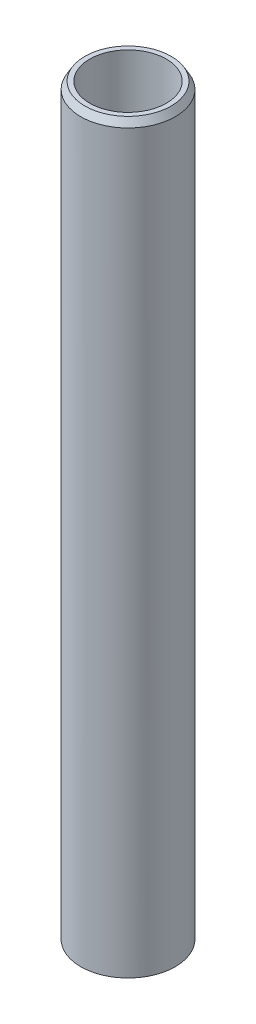
ISO-10303-21;
HEADER;
FILE_DESCRIPTION(('STEP AP214'),'2;1');
FILE_NAME('part.step','',(''),(''),'','','');
FILE_SCHEMA(('AUTOMOTIVE_DESIGN { 1 0 10303 214 1 1 1 1 }'));
ENDSEC;
DATA;
#1=APPLICATION_CONTEXT('core data for automotive mechanical design processes');
#2=APPLICATION_PROTOCOL_DEFINITION('international standard','automotive_design',2000,#1);
#3=PRODUCT_CONTEXT('',#1,'mechanical');
#4=PRODUCT('Part','Part','',(#3));
#5=PRODUCT_RELATED_PRODUCT_CATEGORY('part','',(#4));
#6=PRODUCT_DEFINITION_FORMATION('','',#4);
#7=PRODUCT_DEFINITION_CONTEXT('part definition',#1,'design');
#8=PRODUCT_DEFINITION('design','',#6,#7);
#9=PRODUCT_DEFINITION_SHAPE('','',#8);
#10=(LENGTH_UNIT() NAMED_UNIT(*) SI_UNIT(.MILLI.,.METRE.));
#11=(NAMED_UNIT(*) PLANE_ANGLE_UNIT() SI_UNIT($,.RADIAN.));
#12=(NAMED_UNIT(*) SI_UNIT($,.STERADIAN.) SOLID_ANGLE_UNIT());
#13=UNCERTAINTY_MEASURE_WITH_UNIT(LENGTH_MEASURE(1.E-05),#10,'distance_accuracy_value','');
#14=(GEOMETRIC_REPRESENTATION_CONTEXT(3) GLOBAL_UNCERTAINTY_ASSIGNED_CONTEXT((#13)) GLOBAL_UNIT_ASSIGNED_CONTEXT((#10,
#11,#12)) REPRESENTATION_CONTEXT('',''));
#15=CARTESIAN_POINT('',(0.,0.,0.));
#16=DIRECTION('',(0.,0.,1.));
#17=DIRECTION('',(1.,0.,0.));
#18=AXIS2_PLACEMENT_3D('',#15,#16,#17);
#19=CARTESIAN_POINT('',(0.,394.906210515906,0.));
#20=DIRECTION('',(0.,-1.,0.));
#21=DIRECTION('',(0.,0.,-1.));
#22=AXIS2_PLACEMENT_3D('',#19,#20,#21);
#23=CYLINDRICAL_SURFACE('',#22,25.);
#24=CARTESIAN_POINT('',(0.,391.134064799975,0.));
#25=DIRECTION('',(0.,1.,0.));
#26=DIRECTION('',(0.,0.,1.));
#27=AXIS2_PLACEMENT_3D('',#24,#25,#26);
#28=CIRCLE('',#27,25.);
#29=CARTESIAN_POINT('',(0.,391.134064799975,-25.));
#30=VERTEX_POINT('',#29);
#31=EDGE_CURVE('E50',#30,#30,#28,.F.);
#32=CARTESIAN_POINT('',(0.,2.21889068975195,0.));
#33=DIRECTION('',(0.,1.,0.));
#34=DIRECTION('',(0.,0.,1.));
#35=AXIS2_PLACEMENT_3D('',#32,#33,#34);
#36=CIRCLE('',#35,25.);
#37=CARTESIAN_POINT('',(0.,2.21889068975195,-25.));
#38=VERTEX_POINT('',#37);
#39=EDGE_CURVE('E51',#38,#38,#36,.T.);
#40=CARTESIAN_POINT('',(0.,391.134064799975,-25.));
#41=CARTESIAN_POINT('',(0.,387.08286506966,-25.));
#42=CARTESIAN_POINT('',(0.,383.031665339345,-25.));
#43=CARTESIAN_POINT('',(0.,374.929265878716,-25.));
#44=CARTESIAN_POINT('',(0.,370.878066148401,-25.));
#45=CARTESIAN_POINT('',(0.,362.775666687771,-25.));
#46=CARTESIAN_POINT('',(0.,358.724466957456,-25.));
#47=CARTESIAN_POINT('',(0.,350.622067496827,-25.));
#48=CARTESIAN_POINT('',(0.,346.570867766512,-25.));
#49=CARTESIAN_POINT('',(0.,338.468468305882,-25.));
#50=CARTESIAN_POINT('',(0.,334.417268575567,-25.));
#51=CARTESIAN_POINT('',(0.,326.314869114938,-25.));
#52=CARTESIAN_POINT('',(0.,322.263669384623,-25.));
#53=CARTESIAN_POINT('',(0.,314.161269923993,-25.));
#54=CARTESIAN_POINT('',(0.,310.110070193679,-25.));
#55=CARTESIAN_POINT('',(0.,302.007670733049,-25.));
#56=CARTESIAN_POINT('',(0.,297.956471002734,-25.));
#57=CARTESIAN_POINT('',(0.,289.854071542104,-25.));
#58=CARTESIAN_POINT('',(0.,285.80287181179,-25.));
#59=CARTESIAN_POINT('',(0.,277.70047235116,-25.));
#60=CARTESIAN_POINT('',(0.,273.649272620845,-25.));
#61=CARTESIAN_POINT('',(0.,265.546873160215,-25.));
#62=CARTESIAN_POINT('',(0.,261.495673429901,-25.));
#63=CARTESIAN_POINT('',(0.,253.393273969271,-25.));
#64=CARTESIAN_POINT('',(0.,249.342074238956,-25.));
#65=CARTESIAN_POINT('',(0.,241.239674778327,-25.));
#66=CARTESIAN_POINT('',(0.,237.188475048012,-25.));
#67=CARTESIAN_POINT('',(0.,229.086075587382,-25.));
#68=CARTESIAN_POINT('',(0.,225.034875857067,-25.));
#69=CARTESIAN_POINT('',(0.,216.932476396438,-25.));
#70=CARTESIAN_POINT('',(0.,212.881276666123,-25.));
#71=CARTESIAN_POINT('',(0.,204.778877205493,-25.));
#72=CARTESIAN_POINT('',(0.,200.727677475178,-25.));
#73=CARTESIAN_POINT('',(0.,192.625278014549,-25.));
#74=CARTESIAN_POINT('',(0.,188.574078284234,-25.));
#75=CARTESIAN_POINT('',(0.,180.471678823604,-25.));
#76=CARTESIAN_POINT('',(0.,176.420479093289,-25.));
#77=CARTESIAN_POINT('',(0.,168.31807963266,-25.));
#78=CARTESIAN_POINT('',(0.,164.266879902345,-25.));
#79=CARTESIAN_POINT('',(0.,156.164480441715,-25.));
#80=CARTESIAN_POINT('',(0.,152.1132807114,-25.));
#81=CARTESIAN_POINT('',(0.,144.010881250771,-25.));
#82=CARTESIAN_POINT('',(0.,139.959681520456,-25.));
#83=CARTESIAN_POINT('',(0.,131.857282059826,-25.));
#84=CARTESIAN_POINT('',(0.,127.806082329511,-25.));
#85=CARTESIAN_POINT('',(0.,119.703682868882,-25.));
#86=CARTESIAN_POINT('',(0.,115.652483138567,-25.));
#87=CARTESIAN_POINT('',(0.,107.550083677937,-25.));
#88=CARTESIAN_POINT('',(0.,103.498883947623,-25.));
#89=CARTESIAN_POINT('',(0.,95.3964844869929,-25.));
#90=CARTESIAN_POINT('',(0.,91.3452847566781,-25.));
#91=CARTESIAN_POINT('',(0.,83.2428852960484,-25.));
#92=CARTESIAN_POINT('',(0.,79.1916855657336,-25.));
#93=CARTESIAN_POINT('',(0.,71.089286105104,-25.));
#94=CARTESIAN_POINT('',(0.,67.0380863747891,-25.));
#95=CARTESIAN_POINT('',(0.,58.9356869141595,-25.));
#96=CARTESIAN_POINT('',(0.,54.8844871838447,-25.));
#97=CARTESIAN_POINT('',(0.,46.782087723215,-25.));
#98=CARTESIAN_POINT('',(0.,42.7308879929002,-25.));
#99=CARTESIAN_POINT('',(0.,34.6284885322706,-25.));
#100=CARTESIAN_POINT('',(0.,30.5772888019557,-25.));
#101=CARTESIAN_POINT('',(0.,22.4748893413261,-25.));
#102=CARTESIAN_POINT('',(0.,18.4236896110113,-25.));
#103=CARTESIAN_POINT('',(0.,10.3212901503816,-25.));
#104=CARTESIAN_POINT('',(0.,6.27009042006678,-25.));
#105=CARTESIAN_POINT('',(0.,2.21889068975195,-25.));
#106=B_SPLINE_CURVE_WITH_KNOTS('',3,(#40,#41,#42,#43,#44,#45,#46,#47,#48,#49,#50,#51,#52,#53,
#54,#55,#56,#57,#58,#59,#60,#61,#62,#63,#64,#65,#66,#67,#68,#69,#70,#71,#72,#73,#74,#75,#76,#77,
#78,#79,#80,#81,#82,#83,#84,#85,#86,#87,#88,#89,#90,#91,#92,#93,#94,#95,#96,#97,#98,#99,#100,
#101,#102,#103,#104,#105),.UNSPECIFIED.,.F.,.F.,(4,2,2,2,2,2,2,2,2,2,2,2,2,2,2,2,2,2,2,2,2,2,2,
2,2,2,2,2,2,2,2,2,4),(0.,12.1535991909444,24.3071983818889,36.4607975728334,48.6143967637778,
60.7679959547223,72.9215951456668,85.0751943366113,97.2287935275557,109.3823927185,
121.535991909445,133.689591100389,145.843190291334,157.996789482278,170.150388673223,
182.303987864167,194.457587055111,206.611186246056,218.764785437,230.918384627945,
243.071983818889,255.225583009834,267.379182200778,279.532781391723,291.686380582667,
303.839979773612,315.993578964556,328.147178155501,340.300777346445,352.45437653739,
364.607975728334,376.761574919279,388.915174110223),.UNSPECIFIED.);
#107=EDGE_CURVE('BSEAM39',#30,#38,#106,.T.);
#108=ORIENTED_EDGE('',*,*,#31,.T.);
#109=ORIENTED_EDGE('',*,*,#39,.T.);
#110=ORIENTED_EDGE('',*,*,#107,.T.);
#111=ORIENTED_EDGE('',*,*,#107,.F.);
#112=EDGE_LOOP('',(#108,#110,#109,#111));
#113=FACE_BOUND('',#112,.T.);
#114=ADVANCED_FACE('F39',(#113),#23,.T.);
#115=CARTESIAN_POINT('',(0.,394.906210515906,0.));
#116=DIRECTION('',(0.,1.,0.));
#117=DIRECTION('',(0.,0.,1.));
#118=AXIS2_PLACEMENT_3D('',#115,#116,#117);
#119=PLANE('',#118);
#120=CARTESIAN_POINT('',(0.,394.906210515906,0.));
#121=DIRECTION('',(0.,1.,0.));
#122=DIRECTION('',(0.,0.,1.));
#123=AXIS2_PLACEMENT_3D('',#120,#121,#122);
#124=CIRCLE('',#123,22.7811093102485);
#125=CARTESIAN_POINT('',(0.,394.906210515906,22.7811093102485));
#126=VERTEX_POINT('',#125);
#127=EDGE_CURVE('E54',#126,#126,#124,.T.);
#128=ORIENTED_EDGE('',*,*,#127,.T.);
#129=EDGE_LOOP('',(#128));
#130=FACE_BOUND('',#129,.T.);
#131=CARTESIAN_POINT('',(0.,394.906210515906,0.));
#132=DIRECTION('',(0.,1.,0.));
#133=DIRECTION('',(0.,0.,1.));
#134=AXIS2_PLACEMENT_3D('',#131,#132,#133);
#135=CIRCLE('',#134,20.2398926656003);
#136=CARTESIAN_POINT('',(0.,394.906210515906,-20.2398926656003));
#137=VERTEX_POINT('',#136);
#138=EDGE_CURVE('E58',#137,#137,#135,.T.);
#139=ORIENTED_EDGE('',*,*,#138,.F.);
#140=EDGE_LOOP('',(#139));
#141=FACE_BOUND('',#140,.T.);
#142=ADVANCED_FACE('F69',(#130,#141),#119,.T.);
#143=CARTESIAN_POINT('',(0.,0.,0.));
#144=DIRECTION('',(0.,1.,0.));
#145=DIRECTION('',(0.,0.,1.));
#146=AXIS2_PLACEMENT_3D('',#143,#144,#145);
#147=PLANE('',#146);
#148=CARTESIAN_POINT('',(0.,0.,0.));
#149=DIRECTION('',(0.,1.,0.));
#150=DIRECTION('',(0.,0.,1.));
#151=AXIS2_PLACEMENT_3D('',#148,#149,#150);
#152=CIRCLE('',#151,21.2278542840681);
#153=CARTESIAN_POINT('',(0.,0.,21.2278542840681));
#154=VERTEX_POINT('',#153);
#155=EDGE_CURVE('E10',#154,#154,#152,.F.);
#156=ORIENTED_EDGE('',*,*,#155,.T.);
#157=EDGE_LOOP('',(#156));
#158=FACE_BOUND('',#157,.T.);
#159=CARTESIAN_POINT('',(0.,0.,0.));
#160=DIRECTION('',(0.,1.,0.));
#161=DIRECTION('',(0.,0.,1.));
#162=AXIS2_PLACEMENT_3D('',#159,#160,#161);
#163=CIRCLE('',#162,20.2398926656003);
#164=CARTESIAN_POINT('',(0.,0.,-20.2398926656003));
#165=VERTEX_POINT('',#164);
#166=EDGE_CURVE('E63',#165,#165,#163,.T.);
#167=ORIENTED_EDGE('',*,*,#166,.T.);
#168=EDGE_LOOP('',(#167));
#169=FACE_BOUND('',#168,.T.);
#170=ADVANCED_FACE('F75',(#158,#169),#147,.F.);
#171=CARTESIAN_POINT('',(0.,394.906210515906,0.));
#172=DIRECTION('',(0.,-1.,0.));
#173=DIRECTION('',(0.,0.,-1.));
#174=AXIS2_PLACEMENT_3D('',#171,#172,#173);
#175=CYLINDRICAL_SURFACE('',#174,20.2398926656003);
#176=CARTESIAN_POINT('',(0.,394.906210515906,-20.2398926656003));
#177=CARTESIAN_POINT('',(0.,390.792604156365,-20.2398926656003));
#178=CARTESIAN_POINT('',(0.,386.678997796825,-20.2398926656003));
#179=CARTESIAN_POINT('',(0.,378.451785077743,-20.2398926656003));
#180=CARTESIAN_POINT('',(0.,374.338178718203,-20.2398926656003));
#181=CARTESIAN_POINT('',(0.,366.110965999121,-20.2398926656003));
#182=CARTESIAN_POINT('',(0.,361.997359639581,-20.2398926656003));
#183=CARTESIAN_POINT('',(0.,353.770146920499,-20.2398926656003));
#184=CARTESIAN_POINT('',(0.,349.656540560958,-20.2398926656003));
#185=CARTESIAN_POINT('',(0.,341.429327841877,-20.2398926656003));
#186=CARTESIAN_POINT('',(0.,337.315721482336,-20.2398926656003));
#187=CARTESIAN_POINT('',(0.,329.088508763255,-20.2398926656003));
#188=CARTESIAN_POINT('',(0.,324.974902403714,-20.2398926656003));
#189=CARTESIAN_POINT('',(0.,316.747689684633,-20.2398926656003));
#190=CARTESIAN_POINT('',(0.,312.634083325092,-20.2398926656003));
#191=CARTESIAN_POINT('',(0.,304.406870606011,-20.2398926656003));
#192=CARTESIAN_POINT('',(0.,300.29326424647,-20.2398926656003));
#193=CARTESIAN_POINT('',(0.,292.066051527389,-20.2398926656003));
#194=CARTESIAN_POINT('',(0.,287.952445167848,-20.2398926656003));
#195=CARTESIAN_POINT('',(0.,279.725232448767,-20.2398926656003));
#196=CARTESIAN_POINT('',(0.,275.611626089226,-20.2398926656003));
#197=CARTESIAN_POINT('',(0.,267.384413370145,-20.2398926656003));
#198=CARTESIAN_POINT('',(0.,263.270807010604,-20.2398926656003));
#199=CARTESIAN_POINT('',(0.,255.043594291523,-20.2398926656003));
#200=CARTESIAN_POINT('',(0.,250.929987931982,-20.2398926656003));
#201=CARTESIAN_POINT('',(0.,242.702775212901,-20.2398926656003));
#202=CARTESIAN_POINT('',(0.,238.58916885336,-20.2398926656003));
#203=CARTESIAN_POINT('',(0.,230.361956134279,-20.2398926656003));
#204=CARTESIAN_POINT('',(0.,226.248349774738,-20.2398926656003));
#205=CARTESIAN_POINT('',(0.,218.021137055656,-20.2398926656003));
#206=CARTESIAN_POINT('',(0.,213.907530696116,-20.2398926656003));
#207=CARTESIAN_POINT('',(0.,205.680317977034,-20.2398926656003));
#208=CARTESIAN_POINT('',(0.,201.566711617494,-20.2398926656003));
#209=CARTESIAN_POINT('',(0.,193.339498898412,-20.2398926656003));
#210=CARTESIAN_POINT('',(0.,189.225892538872,-20.2398926656003));
#211=CARTESIAN_POINT('',(0.,180.99867981979,-20.2398926656003));
#212=CARTESIAN_POINT('',(0.,176.88507346025,-20.2398926656003));
#213=CARTESIAN_POINT('',(0.,168.657860741168,-20.2398926656003));
#214=CARTESIAN_POINT('',(0.,164.544254381627,-20.2398926656003));
#215=CARTESIAN_POINT('',(0.,156.317041662546,-20.2398926656003));
#216=CARTESIAN_POINT('',(0.,152.203435303005,-20.2398926656003));
#217=CARTESIAN_POINT('',(0.,143.976222583924,-20.2398926656003));
#218=CARTESIAN_POINT('',(0.,139.862616224383,-20.2398926656003));
#219=CARTESIAN_POINT('',(0.,131.635403505302,-20.2398926656003));
#220=CARTESIAN_POINT('',(0.,127.521797145761,-20.2398926656003));
#221=CARTESIAN_POINT('',(0.,119.29458442668,-20.2398926656003));
#222=CARTESIAN_POINT('',(0.,115.180978067139,-20.2398926656003));
#223=CARTESIAN_POINT('',(0.,106.953765348058,-20.2398926656003));
#224=CARTESIAN_POINT('',(0.,102.840158988517,-20.2398926656003));
#225=CARTESIAN_POINT('',(0.,94.6129462694358,-20.2398926656003));
#226=CARTESIAN_POINT('',(0.,90.4993399098951,-20.2398926656003));
#227=CARTESIAN_POINT('',(0.,82.2721271908138,-20.2398926656003));
#228=CARTESIAN_POINT('',(0.,78.1585208312731,-20.2398926656003));
#229=CARTESIAN_POINT('',(0.,69.9313081121917,-20.2398926656003));
#230=CARTESIAN_POINT('',(0.,65.817701752651,-20.2398926656003));
#231=CARTESIAN_POINT('',(0.,57.5904890335696,-20.2398926656003));
#232=CARTESIAN_POINT('',(0.,53.4768826740289,-20.2398926656003));
#233=CARTESIAN_POINT('',(0.,45.2496699549475,-20.2398926656003));
#234=CARTESIAN_POINT('',(0.,41.1360635954069,-20.2398926656003));
#235=CARTESIAN_POINT('',(0.,32.9088508763255,-20.2398926656003));
#236=CARTESIAN_POINT('',(0.,28.7952445167848,-20.2398926656003));
#237=CARTESIAN_POINT('',(0.,20.5680317977034,-20.2398926656003));
#238=CARTESIAN_POINT('',(0.,16.4544254381627,-20.2398926656003));
#239=CARTESIAN_POINT('',(0.,8.22721271908132,-20.2398926656003));
#240=CARTESIAN_POINT('',(0.,4.11360635954063,-20.2398926656003));
#241=CARTESIAN_POINT('',(0.,0.,-20.2398926656003));
#242=B_SPLINE_CURVE_WITH_KNOTS('',3,(#176,#177,#178,#179,#180,#181,#182,#183,#184,#185,#186,
#187,#188,#189,#190,#191,#192,#193,#194,#195,#196,#197,#198,#199,#200,#201,#202,#203,#204,#205,
#206,#207,#208,#209,#210,#211,#212,#213,#214,#215,#216,#217,#218,#219,#220,#221,#222,#223,#224,
#225,#226,#227,#228,#229,#230,#231,#232,#233,#234,#235,#236,#237,#238,#239,#240,#241),
.UNSPECIFIED.,.F.,.F.,(4,2,2,2,2,2,2,2,2,2,2,2,2,2,2,2,2,2,2,2,2,2,2,2,2,2,2,2,2,2,2,2,4),(0.,
12.3408190786221,24.6816381572442,37.0224572358662,49.3632763144883,61.7040953931104,
74.0449144717325,86.3857335503545,98.7265526289766,111.067371707599,123.408190786221,
135.749009864843,148.089828943465,160.430648022087,172.771467100709,185.112286179331,
197.453105257953,209.793924336575,222.134743415197,234.475562493819,246.816381572441,
259.157200651063,271.498019729685,283.838838808308,296.17965788693,308.520476965552,
320.861296044174,333.202115122796,345.542934201418,357.88375328004,370.224572358662,
382.565391437284,394.906210515906),.UNSPECIFIED.);
#243=EDGE_CURVE('BSEAM70',#137,#165,#242,.T.);
#244=ORIENTED_EDGE('',*,*,#138,.T.);
#245=ORIENTED_EDGE('',*,*,#166,.F.);
#246=ORIENTED_EDGE('',*,*,#243,.T.);
#247=ORIENTED_EDGE('',*,*,#243,.F.);
#248=EDGE_LOOP('',(#244,#246,#245,#247));
#249=FACE_BOUND('',#248,.T.);
#250=ADVANCED_FACE('F70',(#249),#175,.F.);
#251=CARTESIAN_POINT('',(0.,394.906210515906,0.));
#252=DIRECTION('',(0.,-1.,0.));
#253=DIRECTION('',(0.,0.,-1.));
#254=AXIS2_PLACEMENT_3D('',#251,#252,#253);
#255=CONICAL_SURFACE('',#254,22.7811093102485,0.531720412828724);
#256=ORIENTED_EDGE('',*,*,#31,.F.);
#257=EDGE_LOOP('',(#256));
#258=FACE_BOUND('',#257,.T.);
#259=ORIENTED_EDGE('',*,*,#127,.F.);
#260=EDGE_LOOP('',(#259));
#261=FACE_BOUND('',#260,.T.);
#262=ADVANCED_FACE('F81',(#258,#261),#255,.T.);
#263=CARTESIAN_POINT('',(0.,2.21889068975195,0.));
#264=DIRECTION('',(0.,1.,0.));
#265=DIRECTION('',(0.,0.,1.));
#266=AXIS2_PLACEMENT_3D('',#263,#264,#265);
#267=CONICAL_SURFACE('',#266,25.,1.03907591396617);
#268=ORIENTED_EDGE('',*,*,#155,.F.);
#269=EDGE_LOOP('',(#268));
#270=FACE_BOUND('',#269,.T.);
#271=ORIENTED_EDGE('',*,*,#39,.F.);
#272=EDGE_LOOP('',(#271));
#273=FACE_BOUND('',#272,.T.);
#274=ADVANCED_FACE('F45',(#270,#273),#267,.T.);
#275=CLOSED_SHELL('',(#114,#142,#170,#250,#262,#274));
#276=MANIFOLD_SOLID_BREP('B2',#275);
#277=ADVANCED_BREP_SHAPE_REPRESENTATION('',(#18,#276),#14);
#278=SHAPE_DEFINITION_REPRESENTATION(#9,#277);
ENDSEC;
END-ISO-10303-21;
